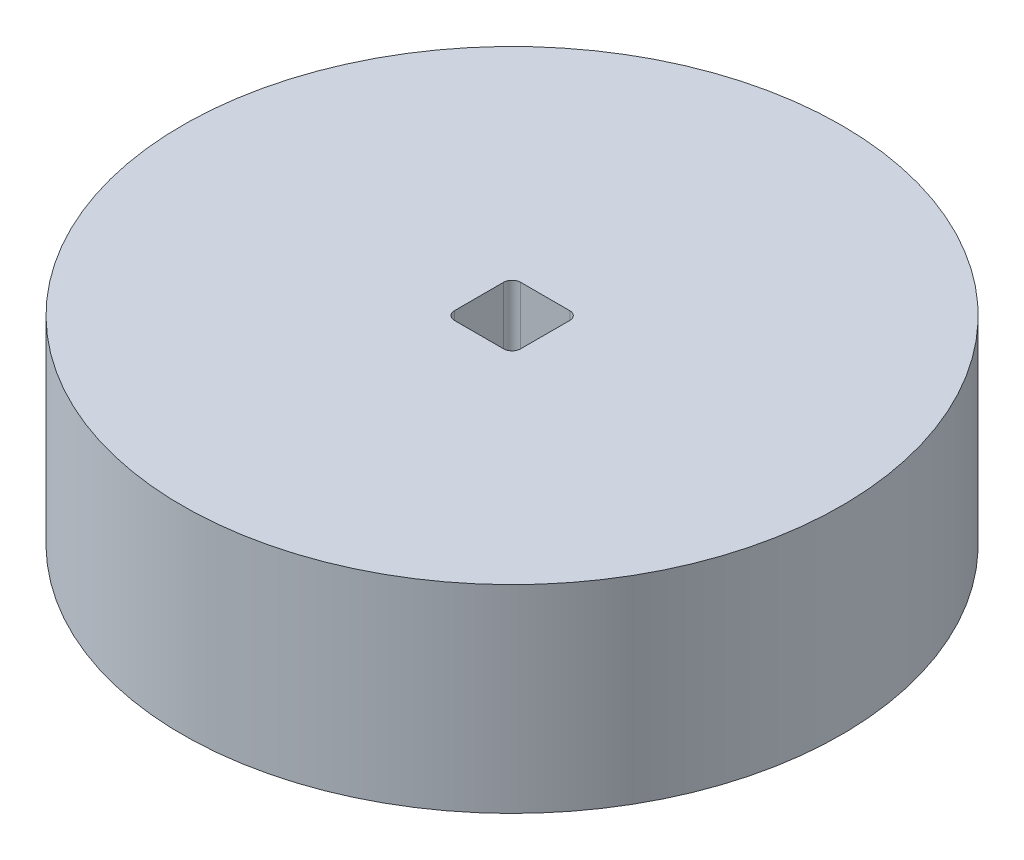
ISO-10303-21;
HEADER;
FILE_DESCRIPTION(('STEP AP214'),'2;1');
FILE_NAME('part.step','',(''),(''),'','','');
FILE_SCHEMA(('AUTOMOTIVE_DESIGN { 1 0 10303 214 1 1 1 1 }'));
ENDSEC;
DATA;
#1=APPLICATION_CONTEXT('core data for automotive mechanical design processes');
#2=APPLICATION_PROTOCOL_DEFINITION('international standard','automotive_design',2000,#1);
#3=PRODUCT_CONTEXT('',#1,'mechanical');
#4=PRODUCT('Part','Part','',(#3));
#5=PRODUCT_RELATED_PRODUCT_CATEGORY('part','',(#4));
#6=PRODUCT_DEFINITION_FORMATION('','',#4);
#7=PRODUCT_DEFINITION_CONTEXT('part definition',#1,'design');
#8=PRODUCT_DEFINITION('design','',#6,#7);
#9=PRODUCT_DEFINITION_SHAPE('','',#8);
#10=(LENGTH_UNIT() NAMED_UNIT(*) SI_UNIT(.MILLI.,.METRE.));
#11=(NAMED_UNIT(*) PLANE_ANGLE_UNIT() SI_UNIT($,.RADIAN.));
#12=(NAMED_UNIT(*) SI_UNIT($,.STERADIAN.) SOLID_ANGLE_UNIT());
#13=UNCERTAINTY_MEASURE_WITH_UNIT(LENGTH_MEASURE(1.E-05),#10,'distance_accuracy_value','');
#14=(GEOMETRIC_REPRESENTATION_CONTEXT(3) GLOBAL_UNCERTAINTY_ASSIGNED_CONTEXT((#13)) GLOBAL_UNIT_ASSIGNED_CONTEXT((#10,
#11,#12)) REPRESENTATION_CONTEXT('',''));
#15=CARTESIAN_POINT('',(0.,0.,0.));
#16=DIRECTION('',(0.,0.,1.));
#17=DIRECTION('',(1.,0.,0.));
#18=AXIS2_PLACEMENT_3D('',#15,#16,#17);
#19=CARTESIAN_POINT('',(0.,21.,0.));
#20=DIRECTION('',(0.,1.,0.));
#21=DIRECTION('',(0.,0.,1.));
#22=AXIS2_PLACEMENT_3D('',#19,#20,#21);
#23=PLANE('',#22);
#24=CARTESIAN_POINT('',(0.,21.,0.));
#25=DIRECTION('',(0.,1.,0.));
#26=DIRECTION('',(0.,0.,1.));
#27=AXIS2_PLACEMENT_3D('',#24,#25,#26);
#28=CIRCLE('',#27,34.925);
#29=CARTESIAN_POINT('',(0.,21.,-34.925));
#30=VERTEX_POINT('',#29);
#31=EDGE_CURVE('E12',#30,#30,#28,.T.);
#32=ORIENTED_EDGE('',*,*,#31,.T.);
#33=EDGE_LOOP('',(#32));
#34=FACE_BOUND('',#33,.T.);
#35=DIRECTION('',(0.,0.,-1.));
#36=VECTOR('',#35,1.);
#37=CARTESIAN_POINT('',(3.50865845317246,21.,2.60402674850779));
#38=LINE('',#37,#36);
#39=CARTESIAN_POINT('',(3.50865845317246,21.,2.60402674850779));
#40=VERTEX_POINT('',#39);
#41=CARTESIAN_POINT('',(3.50865845317246,21.,-2.60597349949221));
#42=VERTEX_POINT('',#41);
#43=EDGE_CURVE('E135',#40,#42,#38,.T.);
#44=ORIENTED_EDGE('',*,*,#43,.F.);
#45=CARTESIAN_POINT('',(2.60865847517246,21.,2.60402674850779));
#46=DIRECTION('',(0.,1.,0.));
#47=DIRECTION('',(0.,0.,1.));
#48=AXIS2_PLACEMENT_3D('',#45,#46,#47);
#49=CIRCLE('',#48,0.899999978);
#50=CARTESIAN_POINT('',(2.60865847517246,21.,3.50402672650779));
#51=VERTEX_POINT('',#50);
#52=EDGE_CURVE('E127',#51,#40,#49,.T.);
#53=ORIENTED_EDGE('',*,*,#52,.F.);
#54=DIRECTION('',(-1.,0.,0.));
#55=VECTOR('',#54,1.);
#56=CARTESIAN_POINT('',(2.60865847517246,21.,3.50402672650779));
#57=LINE('',#56,#55);
#58=CARTESIAN_POINT('',(-2.60134177282754,21.,3.50402672650779));
#59=VERTEX_POINT('',#58);
#60=EDGE_CURVE('E160',#51,#59,#57,.T.);
#61=ORIENTED_EDGE('',*,*,#60,.T.);
#62=CARTESIAN_POINT('',(-2.60134177282754,21.,2.60402674850779));
#63=DIRECTION('',(0.,1.,0.));
#64=DIRECTION('',(0.,0.,1.));
#65=AXIS2_PLACEMENT_3D('',#62,#63,#64);
#66=CIRCLE('',#65,0.899999978);
#67=CARTESIAN_POINT('',(-3.50134175082754,21.,2.60402674850779));
#68=VERTEX_POINT('',#67);
#69=EDGE_CURVE('E158',#68,#59,#66,.T.);
#70=ORIENTED_EDGE('',*,*,#69,.F.);
#71=DIRECTION('',(0.,0.,-1.));
#72=VECTOR('',#71,1.);
#73=CARTESIAN_POINT('',(-3.50134175082754,21.,2.60402674850779));
#74=LINE('',#73,#72);
#75=CARTESIAN_POINT('',(-3.50134175082754,21.,-2.60597349949221));
#76=VERTEX_POINT('',#75);
#77=EDGE_CURVE('E155',#68,#76,#74,.T.);
#78=ORIENTED_EDGE('',*,*,#77,.T.);
#79=CARTESIAN_POINT('',(-2.60134177282754,21.,-2.60597349949221));
#80=DIRECTION('',(0.,1.,0.));
#81=DIRECTION('',(0.,0.,1.));
#82=AXIS2_PLACEMENT_3D('',#79,#80,#81);
#83=CIRCLE('',#82,0.899999978);
#84=CARTESIAN_POINT('',(-2.60134177282754,21.,-3.50597347749221));
#85=VERTEX_POINT('',#84);
#86=EDGE_CURVE('E153',#85,#76,#83,.T.);
#87=ORIENTED_EDGE('',*,*,#86,.F.);
#88=DIRECTION('',(1.,0.,0.));
#89=VECTOR('',#88,1.);
#90=CARTESIAN_POINT('',(-2.60134177282754,21.,-3.50597347749221));
#91=LINE('',#90,#89);
#92=CARTESIAN_POINT('',(2.60865847517246,21.,-3.50597347749221));
#93=VERTEX_POINT('',#92);
#94=EDGE_CURVE('E149',#85,#93,#91,.T.);
#95=ORIENTED_EDGE('',*,*,#94,.T.);
#96=CARTESIAN_POINT('',(2.60865847517246,21.,-2.60597349949221));
#97=DIRECTION('',(0.,1.,0.));
#98=DIRECTION('',(0.,0.,1.));
#99=AXIS2_PLACEMENT_3D('',#96,#97,#98);
#100=CIRCLE('',#99,0.899999978);
#101=EDGE_CURVE('E147',#42,#93,#100,.T.);
#102=ORIENTED_EDGE('',*,*,#101,.F.);
#103=EDGE_LOOP('',(#44,#53,#61,#70,#78,#87,#95,#102));
#104=FACE_BOUND('',#103,.T.);
#105=ADVANCED_FACE('F62',(#34,#104),#23,.T.);
#106=CARTESIAN_POINT('',(0.,0.,0.));
#107=DIRECTION('',(0.,1.,0.));
#108=DIRECTION('',(0.,0.,1.));
#109=AXIS2_PLACEMENT_3D('',#106,#107,#108);
#110=PLANE('',#109);
#111=CARTESIAN_POINT('',(0.,0.,0.));
#112=DIRECTION('',(0.,1.,0.));
#113=DIRECTION('',(0.,0.,1.));
#114=AXIS2_PLACEMENT_3D('',#111,#112,#113);
#115=CIRCLE('',#114,34.925);
#116=CARTESIAN_POINT('',(0.,0.,-34.925));
#117=VERTEX_POINT('',#116);
#118=EDGE_CURVE('E66',#117,#117,#115,.T.);
#119=ORIENTED_EDGE('',*,*,#118,.F.);
#120=EDGE_LOOP('',(#119));
#121=FACE_BOUND('',#120,.T.);
#122=CARTESIAN_POINT('',(2.60865847517246,0.,2.60402674850779));
#123=DIRECTION('',(0.,1.,0.));
#124=DIRECTION('',(0.,0.,1.));
#125=AXIS2_PLACEMENT_3D('',#122,#123,#124);
#126=CIRCLE('',#125,0.899999978);
#127=CARTESIAN_POINT('',(2.60865847517246,0.,3.50402672650779));
#128=VERTEX_POINT('',#127);
#129=CARTESIAN_POINT('',(3.50865845317246,0.,2.60402674850779));
#130=VERTEX_POINT('',#129);
#131=EDGE_CURVE('E85',#128,#130,#126,.T.);
#132=ORIENTED_EDGE('',*,*,#131,.T.);
#133=DIRECTION('',(0.,0.,-1.));
#134=VECTOR('',#133,1.);
#135=CARTESIAN_POINT('',(3.50865845317246,0.,2.60402674850779));
#136=LINE('',#135,#134);
#137=CARTESIAN_POINT('',(3.50865845317246,0.,-2.60597349949221));
#138=VERTEX_POINT('',#137);
#139=EDGE_CURVE('E142',#130,#138,#136,.T.);
#140=ORIENTED_EDGE('',*,*,#139,.T.);
#141=CARTESIAN_POINT('',(2.60865847517246,0.,-2.60597349949221));
#142=DIRECTION('',(0.,1.,0.));
#143=DIRECTION('',(0.,0.,1.));
#144=AXIS2_PLACEMENT_3D('',#141,#142,#143);
#145=CIRCLE('',#144,0.899999978);
#146=CARTESIAN_POINT('',(2.60865847517246,0.,-3.50597347749221));
#147=VERTEX_POINT('',#146);
#148=EDGE_CURVE('E164',#138,#147,#145,.T.);
#149=ORIENTED_EDGE('',*,*,#148,.T.);
#150=DIRECTION('',(1.,0.,0.));
#151=VECTOR('',#150,1.);
#152=CARTESIAN_POINT('',(-2.60134177282754,0.,-3.50597347749221));
#153=LINE('',#152,#151);
#154=CARTESIAN_POINT('',(-2.60134177282754,0.,-3.50597347749221));
#155=VERTEX_POINT('',#154);
#156=EDGE_CURVE('E167',#155,#147,#153,.T.);
#157=ORIENTED_EDGE('',*,*,#156,.F.);
#158=CARTESIAN_POINT('',(-2.60134177282754,0.,-2.60597349949221));
#159=DIRECTION('',(0.,1.,0.));
#160=DIRECTION('',(0.,0.,1.));
#161=AXIS2_PLACEMENT_3D('',#158,#159,#160);
#162=CIRCLE('',#161,0.899999978);
#163=CARTESIAN_POINT('',(-3.50134175082754,0.,-2.60597349949221));
#164=VERTEX_POINT('',#163);
#165=EDGE_CURVE('E170',#155,#164,#162,.T.);
#166=ORIENTED_EDGE('',*,*,#165,.T.);
#167=DIRECTION('',(0.,0.,-1.));
#168=VECTOR('',#167,1.);
#169=CARTESIAN_POINT('',(-3.50134175082754,0.,2.60402674850779));
#170=LINE('',#169,#168);
#171=CARTESIAN_POINT('',(-3.50134175082754,0.,2.60402674850779));
#172=VERTEX_POINT('',#171);
#173=EDGE_CURVE('E173',#172,#164,#170,.T.);
#174=ORIENTED_EDGE('',*,*,#173,.F.);
#175=CARTESIAN_POINT('',(-2.60134177282754,0.,2.60402674850779));
#176=DIRECTION('',(0.,1.,0.));
#177=DIRECTION('',(0.,0.,1.));
#178=AXIS2_PLACEMENT_3D('',#175,#176,#177);
#179=CIRCLE('',#178,0.899999978);
#180=CARTESIAN_POINT('',(-2.60134177282754,0.,3.50402672650779));
#181=VERTEX_POINT('',#180);
#182=EDGE_CURVE('E176',#172,#181,#179,.T.);
#183=ORIENTED_EDGE('',*,*,#182,.T.);
#184=DIRECTION('',(-1.,0.,0.));
#185=VECTOR('',#184,1.);
#186=CARTESIAN_POINT('',(2.60865847517246,0.,3.50402672650779));
#187=LINE('',#186,#185);
#188=EDGE_CURVE('E136',#128,#181,#187,.T.);
#189=ORIENTED_EDGE('',*,*,#188,.F.);
#190=EDGE_LOOP('',(#132,#140,#149,#157,#166,#174,#183,#189));
#191=FACE_BOUND('',#190,.T.);
#192=ADVANCED_FACE('F196',(#121,#191),#110,.F.);
#193=CARTESIAN_POINT('',(0.,21.,0.));
#194=DIRECTION('',(0.,-1.,0.));
#195=DIRECTION('',(0.,0.,-1.));
#196=AXIS2_PLACEMENT_3D('',#193,#194,#195);
#197=CYLINDRICAL_SURFACE('',#196,34.925);
#198=CARTESIAN_POINT('',(0.,21.,-34.925));
#199=CARTESIAN_POINT('',(0.,20.78125,-34.925));
#200=CARTESIAN_POINT('',(0.,20.5625,-34.925));
#201=CARTESIAN_POINT('',(0.,20.125,-34.925));
#202=CARTESIAN_POINT('',(0.,19.90625,-34.925));
#203=CARTESIAN_POINT('',(0.,19.46875,-34.925));
#204=CARTESIAN_POINT('',(0.,19.25,-34.925));
#205=CARTESIAN_POINT('',(0.,18.8125,-34.925));
#206=CARTESIAN_POINT('',(0.,18.59375,-34.925));
#207=CARTESIAN_POINT('',(0.,18.15625,-34.925));
#208=CARTESIAN_POINT('',(0.,17.9375,-34.925));
#209=CARTESIAN_POINT('',(0.,17.5,-34.925));
#210=CARTESIAN_POINT('',(0.,17.28125,-34.925));
#211=CARTESIAN_POINT('',(0.,16.84375,-34.925));
#212=CARTESIAN_POINT('',(0.,16.625,-34.925));
#213=CARTESIAN_POINT('',(0.,16.1875,-34.925));
#214=CARTESIAN_POINT('',(0.,15.96875,-34.925));
#215=CARTESIAN_POINT('',(0.,15.53125,-34.925));
#216=CARTESIAN_POINT('',(0.,15.3125,-34.925));
#217=CARTESIAN_POINT('',(0.,14.875,-34.925));
#218=CARTESIAN_POINT('',(0.,14.65625,-34.925));
#219=CARTESIAN_POINT('',(0.,14.21875,-34.925));
#220=CARTESIAN_POINT('',(0.,14.,-34.925));
#221=CARTESIAN_POINT('',(0.,13.5625,-34.925));
#222=CARTESIAN_POINT('',(0.,13.34375,-34.925));
#223=CARTESIAN_POINT('',(0.,12.90625,-34.925));
#224=CARTESIAN_POINT('',(0.,12.6875,-34.925));
#225=CARTESIAN_POINT('',(0.,12.25,-34.925));
#226=CARTESIAN_POINT('',(0.,12.03125,-34.925));
#227=CARTESIAN_POINT('',(0.,11.59375,-34.925));
#228=CARTESIAN_POINT('',(0.,11.375,-34.925));
#229=CARTESIAN_POINT('',(0.,10.9375,-34.925));
#230=CARTESIAN_POINT('',(0.,10.71875,-34.925));
#231=CARTESIAN_POINT('',(0.,10.28125,-34.925));
#232=CARTESIAN_POINT('',(0.,10.0625,-34.925));
#233=CARTESIAN_POINT('',(0.,9.625,-34.925));
#234=CARTESIAN_POINT('',(0.,9.40625,-34.925));
#235=CARTESIAN_POINT('',(0.,8.96875,-34.925));
#236=CARTESIAN_POINT('',(0.,8.75,-34.925));
#237=CARTESIAN_POINT('',(0.,8.3125,-34.925));
#238=CARTESIAN_POINT('',(0.,8.09375,-34.925));
#239=CARTESIAN_POINT('',(0.,7.65625,-34.925));
#240=CARTESIAN_POINT('',(0.,7.4375,-34.925));
#241=CARTESIAN_POINT('',(0.,7.,-34.925));
#242=CARTESIAN_POINT('',(0.,6.78125,-34.925));
#243=CARTESIAN_POINT('',(0.,6.34375,-34.925));
#244=CARTESIAN_POINT('',(0.,6.125,-34.925));
#245=CARTESIAN_POINT('',(0.,5.6875,-34.925));
#246=CARTESIAN_POINT('',(0.,5.46875,-34.925));
#247=CARTESIAN_POINT('',(0.,5.03125,-34.925));
#248=CARTESIAN_POINT('',(0.,4.8125,-34.925));
#249=CARTESIAN_POINT('',(0.,4.375,-34.925));
#250=CARTESIAN_POINT('',(0.,4.15625,-34.925));
#251=CARTESIAN_POINT('',(0.,3.71875,-34.925));
#252=CARTESIAN_POINT('',(0.,3.5,-34.925));
#253=CARTESIAN_POINT('',(0.,3.0625,-34.925));
#254=CARTESIAN_POINT('',(0.,2.84375,-34.925));
#255=CARTESIAN_POINT('',(0.,2.40625,-34.925));
#256=CARTESIAN_POINT('',(0.,2.1875,-34.925));
#257=CARTESIAN_POINT('',(0.,1.75,-34.925));
#258=CARTESIAN_POINT('',(0.,1.53125,-34.925));
#259=CARTESIAN_POINT('',(0.,1.09375,-34.925));
#260=CARTESIAN_POINT('',(0.,0.875000000000001,-34.925));
#261=CARTESIAN_POINT('',(0.,0.4375,-34.925));
#262=CARTESIAN_POINT('',(0.,0.21875,-34.925));
#263=CARTESIAN_POINT('',(0.,0.,-34.925));
#264=B_SPLINE_CURVE_WITH_KNOTS('',3,(#198,#199,#200,#201,#202,#203,#204,#205,#206,#207,#208,
#209,#210,#211,#212,#213,#214,#215,#216,#217,#218,#219,#220,#221,#222,#223,#224,#225,#226,#227,
#228,#229,#230,#231,#232,#233,#234,#235,#236,#237,#238,#239,#240,#241,#242,#243,#244,#245,#246,
#247,#248,#249,#250,#251,#252,#253,#254,#255,#256,#257,#258,#259,#260,#261,#262,#263),
.UNSPECIFIED.,.F.,.F.,(4,2,2,2,2,2,2,2,2,2,2,2,2,2,2,2,2,2,2,2,2,2,2,2,2,2,2,2,2,2,2,2,4),(0.,
0.656249999999997,1.3125,1.96875,2.625,3.28125,3.9375,4.59375,5.25,5.90625,6.5625,7.21875,7.875,
8.53125,9.1875,9.84375,10.5,11.15625,11.8125,12.46875,13.125,13.78125,14.4375,15.09375,15.75,
16.40625,17.0625,17.71875,18.375,19.03125,19.6875,20.34375,21.),.UNSPECIFIED.);
#265=EDGE_CURVE('BSEAM64',#30,#117,#264,.T.);
#266=ORIENTED_EDGE('',*,*,#31,.F.);
#267=ORIENTED_EDGE('',*,*,#118,.T.);
#268=ORIENTED_EDGE('',*,*,#265,.T.);
#269=ORIENTED_EDGE('',*,*,#265,.F.);
#270=EDGE_LOOP('',(#266,#268,#267,#269));
#271=FACE_BOUND('',#270,.T.);
#272=ADVANCED_FACE('F64',(#271),#197,.T.);
#273=CARTESIAN_POINT('',(2.60865847517246,21.,2.60402674850779));
#274=DIRECTION('',(0.,-1.,0.));
#275=DIRECTION('',(0.,0.,-1.));
#276=AXIS2_PLACEMENT_3D('',#273,#274,#275);
#277=CYLINDRICAL_SURFACE('',#276,0.899999978);
#278=ORIENTED_EDGE('',*,*,#131,.F.);
#279=DIRECTION('',(0.,-1.,0.));
#280=VECTOR('',#279,1.);
#281=CARTESIAN_POINT('',(2.60865847517246,21.,3.50402672650779));
#282=LINE('',#281,#280);
#283=EDGE_CURVE('E131',#51,#128,#282,.T.);
#284=ORIENTED_EDGE('',*,*,#283,.F.);
#285=ORIENTED_EDGE('',*,*,#52,.T.);
#286=DIRECTION('',(0.,-1.,0.));
#287=VECTOR('',#286,1.);
#288=CARTESIAN_POINT('',(3.50865845317246,21.,2.60402674850779));
#289=LINE('',#288,#287);
#290=EDGE_CURVE('E130',#40,#130,#289,.T.);
#291=ORIENTED_EDGE('',*,*,#290,.T.);
#292=EDGE_LOOP('',(#278,#284,#285,#291));
#293=FACE_BOUND('',#292,.T.);
#294=ADVANCED_FACE('F129',(#293),#277,.F.);
#295=CARTESIAN_POINT('',(3.50865845317246,21.,2.60402674850779));
#296=DIRECTION('',(-1.,0.,0.));
#297=DIRECTION('',(0.,0.,1.));
#298=AXIS2_PLACEMENT_3D('',#295,#296,#297);
#299=PLANE('',#298);
#300=ORIENTED_EDGE('',*,*,#139,.F.);
#301=ORIENTED_EDGE('',*,*,#290,.F.);
#302=ORIENTED_EDGE('',*,*,#43,.T.);
#303=DIRECTION('',(0.,-1.,0.));
#304=VECTOR('',#303,1.);
#305=CARTESIAN_POINT('',(3.50865845317246,21.,-2.60597349949221));
#306=LINE('',#305,#304);
#307=EDGE_CURVE('E143',#42,#138,#306,.T.);
#308=ORIENTED_EDGE('',*,*,#307,.T.);
#309=EDGE_LOOP('',(#300,#301,#302,#308));
#310=FACE_BOUND('',#309,.T.);
#311=ADVANCED_FACE('F139',(#310),#299,.T.);
#312=CARTESIAN_POINT('',(2.60865847517246,21.,-2.60597349949221));
#313=DIRECTION('',(0.,-1.,0.));
#314=DIRECTION('',(0.,0.,-1.));
#315=AXIS2_PLACEMENT_3D('',#312,#313,#314);
#316=CYLINDRICAL_SURFACE('',#315,0.899999978);
#317=ORIENTED_EDGE('',*,*,#148,.F.);
#318=ORIENTED_EDGE('',*,*,#307,.F.);
#319=ORIENTED_EDGE('',*,*,#101,.T.);
#320=DIRECTION('',(0.,-1.,0.));
#321=VECTOR('',#320,1.);
#322=CARTESIAN_POINT('',(2.60865847517246,21.,-3.50597347749221));
#323=LINE('',#322,#321);
#324=EDGE_CURVE('E188',#93,#147,#323,.T.);
#325=ORIENTED_EDGE('',*,*,#324,.T.);
#326=EDGE_LOOP('',(#317,#318,#319,#325));
#327=FACE_BOUND('',#326,.T.);
#328=ADVANCED_FACE('F192',(#327),#316,.F.);
#329=CARTESIAN_POINT('',(-2.60134177282754,21.,-3.50597347749221));
#330=DIRECTION('',(0.,0.,-1.));
#331=DIRECTION('',(-1.,0.,0.));
#332=AXIS2_PLACEMENT_3D('',#329,#330,#331);
#333=PLANE('',#332);
#334=ORIENTED_EDGE('',*,*,#156,.T.);
#335=ORIENTED_EDGE('',*,*,#324,.F.);
#336=ORIENTED_EDGE('',*,*,#94,.F.);
#337=DIRECTION('',(0.,-1.,0.));
#338=VECTOR('',#337,1.);
#339=CARTESIAN_POINT('',(-2.60134177282754,21.,-3.50597347749221));
#340=LINE('',#339,#338);
#341=EDGE_CURVE('E186',#85,#155,#340,.T.);
#342=ORIENTED_EDGE('',*,*,#341,.T.);
#343=EDGE_LOOP('',(#334,#335,#336,#342));
#344=FACE_BOUND('',#343,.T.);
#345=ADVANCED_FACE('F214',(#344),#333,.F.);
#346=CARTESIAN_POINT('',(-2.60134177282754,21.,-2.60597349949221));
#347=DIRECTION('',(0.,-1.,0.));
#348=DIRECTION('',(0.,0.,-1.));
#349=AXIS2_PLACEMENT_3D('',#346,#347,#348);
#350=CYLINDRICAL_SURFACE('',#349,0.899999978);
#351=ORIENTED_EDGE('',*,*,#165,.F.);
#352=ORIENTED_EDGE('',*,*,#341,.F.);
#353=ORIENTED_EDGE('',*,*,#86,.T.);
#354=DIRECTION('',(0.,-1.,0.));
#355=VECTOR('',#354,1.);
#356=CARTESIAN_POINT('',(-3.50134175082754,21.,-2.60597349949221));
#357=LINE('',#356,#355);
#358=EDGE_CURVE('E184',#76,#164,#357,.T.);
#359=ORIENTED_EDGE('',*,*,#358,.T.);
#360=EDGE_LOOP('',(#351,#352,#353,#359));
#361=FACE_BOUND('',#360,.T.);
#362=ADVANCED_FACE('F211',(#361),#350,.F.);
#363=CARTESIAN_POINT('',(-3.50134175082754,21.,2.60402674850779));
#364=DIRECTION('',(-1.,0.,0.));
#365=DIRECTION('',(0.,0.,1.));
#366=AXIS2_PLACEMENT_3D('',#363,#364,#365);
#367=PLANE('',#366);
#368=ORIENTED_EDGE('',*,*,#173,.T.);
#369=ORIENTED_EDGE('',*,*,#358,.F.);
#370=ORIENTED_EDGE('',*,*,#77,.F.);
#371=DIRECTION('',(0.,-1.,0.));
#372=VECTOR('',#371,1.);
#373=CARTESIAN_POINT('',(-3.50134175082754,21.,2.60402674850779));
#374=LINE('',#373,#372);
#375=EDGE_CURVE('E182',#68,#172,#374,.T.);
#376=ORIENTED_EDGE('',*,*,#375,.T.);
#377=EDGE_LOOP('',(#368,#369,#370,#376));
#378=FACE_BOUND('',#377,.T.);
#379=ADVANCED_FACE('F208',(#378),#367,.F.);
#380=CARTESIAN_POINT('',(-2.60134177282754,21.,2.60402674850779));
#381=DIRECTION('',(0.,-1.,0.));
#382=DIRECTION('',(0.,0.,-1.));
#383=AXIS2_PLACEMENT_3D('',#380,#381,#382);
#384=CYLINDRICAL_SURFACE('',#383,0.899999978);
#385=ORIENTED_EDGE('',*,*,#182,.F.);
#386=ORIENTED_EDGE('',*,*,#375,.F.);
#387=ORIENTED_EDGE('',*,*,#69,.T.);
#388=DIRECTION('',(0.,-1.,0.));
#389=VECTOR('',#388,1.);
#390=CARTESIAN_POINT('',(-2.60134177282754,21.,3.50402672650779));
#391=LINE('',#390,#389);
#392=EDGE_CURVE('E77',#59,#181,#391,.T.);
#393=ORIENTED_EDGE('',*,*,#392,.T.);
#394=EDGE_LOOP('',(#385,#386,#387,#393));
#395=FACE_BOUND('',#394,.T.);
#396=ADVANCED_FACE('F205',(#395),#384,.F.);
#397=CARTESIAN_POINT('',(2.60865847517246,21.,3.50402672650779));
#398=DIRECTION('',(0.,0.,1.));
#399=DIRECTION('',(1.,0.,0.));
#400=AXIS2_PLACEMENT_3D('',#397,#398,#399);
#401=PLANE('',#400);
#402=ORIENTED_EDGE('',*,*,#188,.T.);
#403=ORIENTED_EDGE('',*,*,#392,.F.);
#404=ORIENTED_EDGE('',*,*,#60,.F.);
#405=ORIENTED_EDGE('',*,*,#283,.T.);
#406=EDGE_LOOP('',(#402,#403,#404,#405));
#407=FACE_BOUND('',#406,.T.);
#408=ADVANCED_FACE('F200',(#407),#401,.F.);
#409=CLOSED_SHELL('',(#105,#192,#272,#294,#311,#328,#345,#362,#379,#396,#408));
#410=MANIFOLD_SOLID_BREP('B2',#409);
#411=ADVANCED_BREP_SHAPE_REPRESENTATION('',(#18,#410),#14);
#412=SHAPE_DEFINITION_REPRESENTATION(#9,#411);
ENDSEC;
END-ISO-10303-21;
